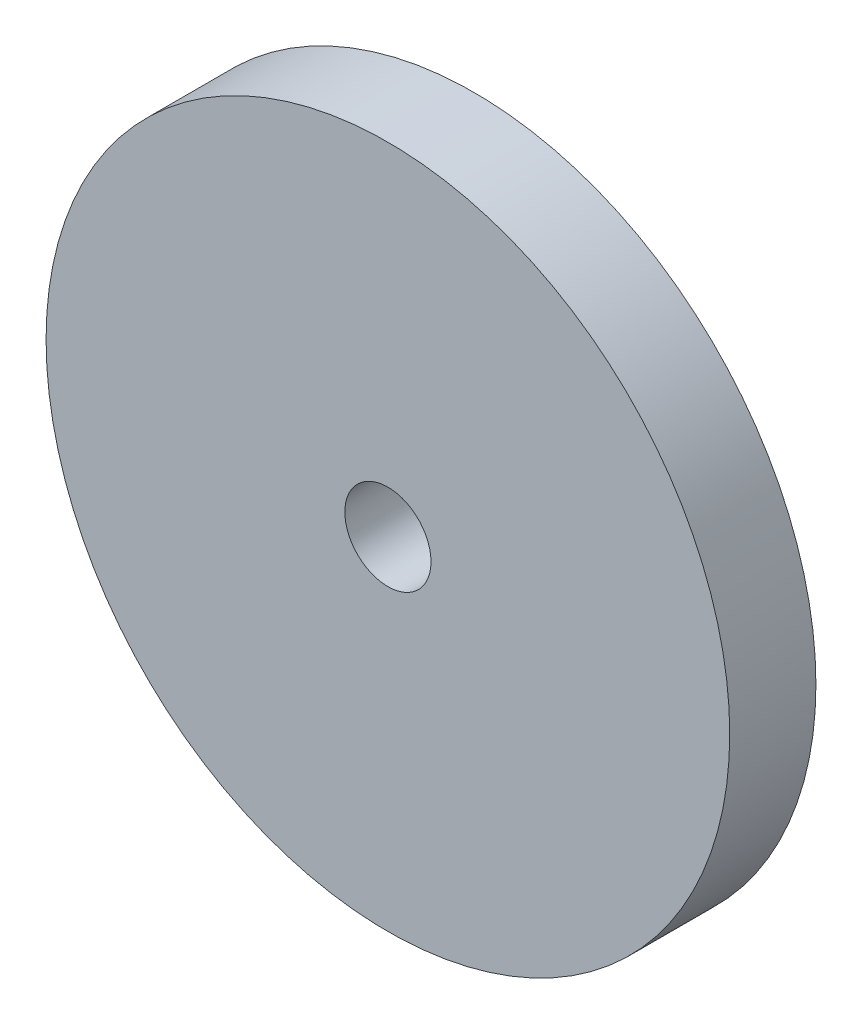
ISO-10303-21;
HEADER;
FILE_DESCRIPTION(('STEP AP214'),'2;1');
FILE_NAME('part.step','',(''),(''),'','','');
FILE_SCHEMA(('AUTOMOTIVE_DESIGN { 1 0 10303 214 1 1 1 1 }'));
ENDSEC;
DATA;
#1=APPLICATION_CONTEXT('core data for automotive mechanical design processes');
#2=APPLICATION_PROTOCOL_DEFINITION('international standard','automotive_design',2000,#1);
#3=PRODUCT_CONTEXT('',#1,'mechanical');
#4=PRODUCT('Part','Part','',(#3));
#5=PRODUCT_RELATED_PRODUCT_CATEGORY('part','',(#4));
#6=PRODUCT_DEFINITION_FORMATION('','',#4);
#7=PRODUCT_DEFINITION_CONTEXT('part definition',#1,'design');
#8=PRODUCT_DEFINITION('design','',#6,#7);
#9=PRODUCT_DEFINITION_SHAPE('','',#8);
#10=(LENGTH_UNIT() NAMED_UNIT(*) SI_UNIT(.MILLI.,.METRE.));
#11=(NAMED_UNIT(*) PLANE_ANGLE_UNIT() SI_UNIT($,.RADIAN.));
#12=(NAMED_UNIT(*) SI_UNIT($,.STERADIAN.) SOLID_ANGLE_UNIT());
#13=UNCERTAINTY_MEASURE_WITH_UNIT(LENGTH_MEASURE(1.E-05),#10,'distance_accuracy_value','');
#14=(GEOMETRIC_REPRESENTATION_CONTEXT(3) GLOBAL_UNCERTAINTY_ASSIGNED_CONTEXT((#13)) GLOBAL_UNIT_ASSIGNED_CONTEXT((#10,
#11,#12)) REPRESENTATION_CONTEXT('',''));
#15=CARTESIAN_POINT('',(0.,0.,0.));
#16=DIRECTION('',(0.,0.,1.));
#17=DIRECTION('',(1.,0.,0.));
#18=AXIS2_PLACEMENT_3D('',#15,#16,#17);
#19=CARTESIAN_POINT('',(55.,31.,3.));
#20=DIRECTION('',(0.,0.,1.));
#21=DIRECTION('',(1.,0.,0.));
#22=AXIS2_PLACEMENT_3D('',#19,#20,#21);
#23=PLANE('',#22);
#24=CARTESIAN_POINT('',(55.,31.,3.));
#25=DIRECTION('',(0.,0.,1.));
#26=DIRECTION('',(1.,0.,0.));
#27=AXIS2_PLACEMENT_3D('',#24,#25,#26);
#28=CIRCLE('',#27,11.9);
#29=CARTESIAN_POINT('',(66.9,31.,3.));
#30=VERTEX_POINT('',#29);
#31=EDGE_CURVE('E10',#30,#30,#28,.T.);
#32=ORIENTED_EDGE('',*,*,#31,.T.);
#33=EDGE_LOOP('',(#32));
#34=FACE_BOUND('',#33,.T.);
#35=CARTESIAN_POINT('',(55.,31.,3.));
#36=DIRECTION('',(0.,0.,1.));
#37=DIRECTION('',(1.,0.,0.));
#38=AXIS2_PLACEMENT_3D('',#35,#36,#37);
#39=CIRCLE('',#38,1.5);
#40=CARTESIAN_POINT('',(56.5,31.,3.));
#41=VERTEX_POINT('',#40);
#42=EDGE_CURVE('E42',#41,#41,#39,.T.);
#43=ORIENTED_EDGE('',*,*,#42,.F.);
#44=EDGE_LOOP('',(#43));
#45=FACE_BOUND('',#44,.T.);
#46=ADVANCED_FACE('F31',(#34,#45),#23,.T.);
#47=CARTESIAN_POINT('',(55.,31.,0.));
#48=DIRECTION('',(0.,0.,1.));
#49=DIRECTION('',(1.,0.,0.));
#50=AXIS2_PLACEMENT_3D('',#47,#48,#49);
#51=PLANE('',#50);
#52=CARTESIAN_POINT('',(55.,31.,0.));
#53=DIRECTION('',(0.,0.,1.));
#54=DIRECTION('',(1.,0.,0.));
#55=AXIS2_PLACEMENT_3D('',#52,#53,#54);
#56=CIRCLE('',#55,11.9);
#57=CARTESIAN_POINT('',(66.9,31.,0.));
#58=VERTEX_POINT('',#57);
#59=EDGE_CURVE('E35',#58,#58,#56,.T.);
#60=ORIENTED_EDGE('',*,*,#59,.F.);
#61=EDGE_LOOP('',(#60));
#62=FACE_BOUND('',#61,.T.);
#63=CARTESIAN_POINT('',(55.,31.,0.));
#64=DIRECTION('',(0.,0.,1.));
#65=DIRECTION('',(1.,0.,0.));
#66=AXIS2_PLACEMENT_3D('',#63,#64,#65);
#67=CIRCLE('',#66,1.5);
#68=CARTESIAN_POINT('',(56.5,31.,0.));
#69=VERTEX_POINT('',#68);
#70=EDGE_CURVE('E44',#69,#69,#67,.T.);
#71=ORIENTED_EDGE('',*,*,#70,.T.);
#72=EDGE_LOOP('',(#71));
#73=FACE_BOUND('',#72,.T.);
#74=ADVANCED_FACE('F54',(#62,#73),#51,.F.);
#75=CARTESIAN_POINT('',(55.,31.,3.));
#76=DIRECTION('',(0.,0.,-1.));
#77=DIRECTION('',(-1.,0.,0.));
#78=AXIS2_PLACEMENT_3D('',#75,#76,#77);
#79=CYLINDRICAL_SURFACE('',#78,11.9);
#80=ORIENTED_EDGE('',*,*,#31,.F.);
#81=EDGE_LOOP('',(#80));
#82=FACE_BOUND('',#81,.T.);
#83=ORIENTED_EDGE('',*,*,#59,.T.);
#84=EDGE_LOOP('',(#83));
#85=FACE_BOUND('',#84,.T.);
#86=ADVANCED_FACE('F33',(#82,#85),#79,.T.);
#87=CARTESIAN_POINT('',(55.,31.,3.));
#88=DIRECTION('',(0.,0.,-1.));
#89=DIRECTION('',(-1.,0.,0.));
#90=AXIS2_PLACEMENT_3D('',#87,#88,#89);
#91=CYLINDRICAL_SURFACE('',#90,1.5);
#92=ORIENTED_EDGE('',*,*,#42,.T.);
#93=EDGE_LOOP('',(#92));
#94=FACE_BOUND('',#93,.T.);
#95=ORIENTED_EDGE('',*,*,#70,.F.);
#96=EDGE_LOOP('',(#95));
#97=FACE_BOUND('',#96,.T.);
#98=ADVANCED_FACE('F50',(#94,#97),#91,.F.);
#99=CLOSED_SHELL('',(#46,#74,#86,#98));
#100=MANIFOLD_SOLID_BREP('B2',#99);
#101=ADVANCED_BREP_SHAPE_REPRESENTATION('',(#18,#100),#14);
#102=SHAPE_DEFINITION_REPRESENTATION(#9,#101);
ENDSEC;
END-ISO-10303-21;
